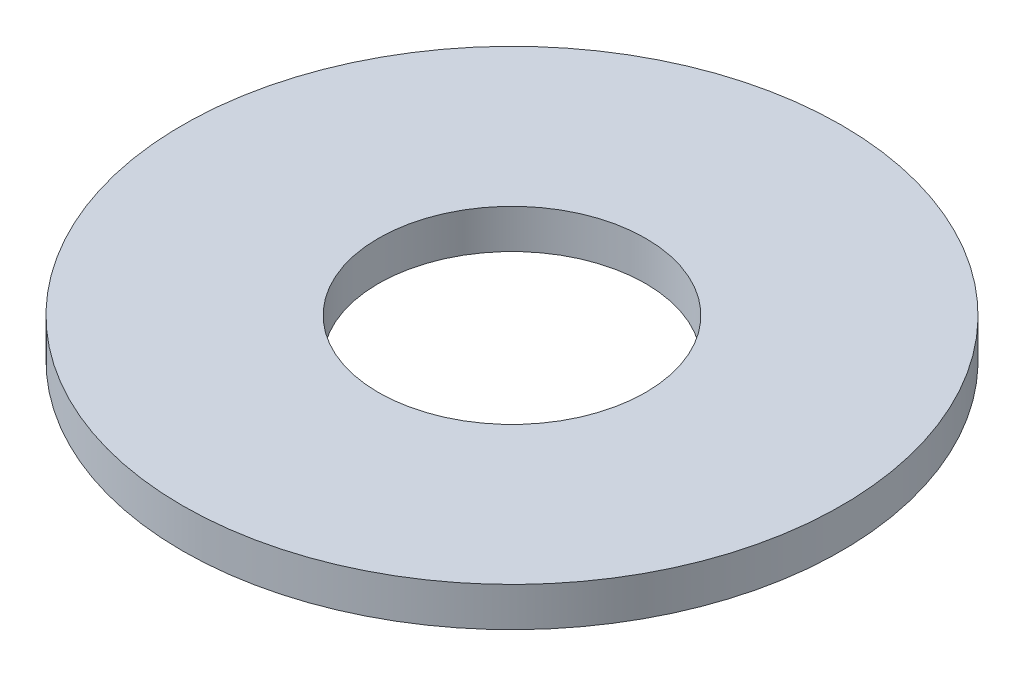
ISO-10303-21;
HEADER;
FILE_DESCRIPTION(('STEP AP214'),'2;1');
FILE_NAME('part.step','',(''),(''),'','','');
FILE_SCHEMA(('AUTOMOTIVE_DESIGN { 1 0 10303 214 1 1 1 1 }'));
ENDSEC;
DATA;
#1=APPLICATION_CONTEXT('core data for automotive mechanical design processes');
#2=APPLICATION_PROTOCOL_DEFINITION('international standard','automotive_design',2000,#1);
#3=PRODUCT_CONTEXT('',#1,'mechanical');
#4=PRODUCT('Part','Part','',(#3));
#5=PRODUCT_RELATED_PRODUCT_CATEGORY('part','',(#4));
#6=PRODUCT_DEFINITION_FORMATION('','',#4);
#7=PRODUCT_DEFINITION_CONTEXT('part definition',#1,'design');
#8=PRODUCT_DEFINITION('design','',#6,#7);
#9=PRODUCT_DEFINITION_SHAPE('','',#8);
#10=(LENGTH_UNIT() NAMED_UNIT(*) SI_UNIT(.MILLI.,.METRE.));
#11=(NAMED_UNIT(*) PLANE_ANGLE_UNIT() SI_UNIT($,.RADIAN.));
#12=(NAMED_UNIT(*) SI_UNIT($,.STERADIAN.) SOLID_ANGLE_UNIT());
#13=UNCERTAINTY_MEASURE_WITH_UNIT(LENGTH_MEASURE(1.E-05),#10,'distance_accuracy_value','');
#14=(GEOMETRIC_REPRESENTATION_CONTEXT(3) GLOBAL_UNCERTAINTY_ASSIGNED_CONTEXT((#13)) GLOBAL_UNIT_ASSIGNED_CONTEXT((#10,
#11,#12)) REPRESENTATION_CONTEXT('',''));
#15=CARTESIAN_POINT('',(0.,0.,0.));
#16=DIRECTION('',(0.,0.,1.));
#17=DIRECTION('',(1.,0.,0.));
#18=AXIS2_PLACEMENT_3D('',#15,#16,#17);
#19=CARTESIAN_POINT('',(0.,11.,0.));
#20=DIRECTION('',(0.,-1.,0.));
#21=DIRECTION('',(0.,0.,-1.));
#22=AXIS2_PLACEMENT_3D('',#19,#20,#21);
#23=CYLINDRICAL_SURFACE('',#22,92.5);
#24=CARTESIAN_POINT('',(0.,11.,0.));
#25=DIRECTION('',(0.,1.,0.));
#26=DIRECTION('',(0.,0.,1.));
#27=AXIS2_PLACEMENT_3D('',#24,#25,#26);
#28=CIRCLE('',#27,92.5);
#29=CARTESIAN_POINT('',(0.,11.,92.5));
#30=VERTEX_POINT('',#29);
#31=EDGE_CURVE('E10',#30,#30,#28,.T.);
#32=ORIENTED_EDGE('',*,*,#31,.F.);
#33=EDGE_LOOP('',(#32));
#34=FACE_BOUND('',#33,.T.);
#35=CARTESIAN_POINT('',(0.,0.,0.));
#36=DIRECTION('',(0.,1.,0.));
#37=DIRECTION('',(0.,0.,1.));
#38=AXIS2_PLACEMENT_3D('',#35,#36,#37);
#39=CIRCLE('',#38,92.5);
#40=CARTESIAN_POINT('',(0.,0.,92.5));
#41=VERTEX_POINT('',#40);
#42=EDGE_CURVE('E37',#41,#41,#39,.T.);
#43=ORIENTED_EDGE('',*,*,#42,.T.);
#44=EDGE_LOOP('',(#43));
#45=FACE_BOUND('',#44,.T.);
#46=ADVANCED_FACE('F40',(#34,#45),#23,.T.);
#47=CARTESIAN_POINT('',(0.,11.,0.));
#48=DIRECTION('',(0.,1.,0.));
#49=DIRECTION('',(0.,0.,1.));
#50=AXIS2_PLACEMENT_3D('',#47,#48,#49);
#51=PLANE('',#50);
#52=CARTESIAN_POINT('',(0.,11.,0.));
#53=DIRECTION('',(0.,1.,0.));
#54=DIRECTION('',(0.,0.,1.));
#55=AXIS2_PLACEMENT_3D('',#52,#53,#54);
#56=CIRCLE('',#55,37.5);
#57=CARTESIAN_POINT('',(0.,11.,37.5));
#58=VERTEX_POINT('',#57);
#59=EDGE_CURVE('E50',#58,#58,#56,.T.);
#60=ORIENTED_EDGE('',*,*,#59,.F.);
#61=EDGE_LOOP('',(#60));
#62=FACE_BOUND('',#61,.T.);
#63=ORIENTED_EDGE('',*,*,#31,.T.);
#64=EDGE_LOOP('',(#63));
#65=FACE_BOUND('',#64,.T.);
#66=ADVANCED_FACE('F59',(#62,#65),#51,.T.);
#67=CARTESIAN_POINT('',(0.,0.,0.));
#68=DIRECTION('',(0.,1.,0.));
#69=DIRECTION('',(0.,0.,1.));
#70=AXIS2_PLACEMENT_3D('',#67,#68,#69);
#71=PLANE('',#70);
#72=CARTESIAN_POINT('',(0.,0.,0.));
#73=DIRECTION('',(0.,1.,0.));
#74=DIRECTION('',(0.,0.,1.));
#75=AXIS2_PLACEMENT_3D('',#72,#73,#74);
#76=CIRCLE('',#75,37.5);
#77=CARTESIAN_POINT('',(0.,0.,37.5));
#78=VERTEX_POINT('',#77);
#79=EDGE_CURVE('E47',#78,#78,#76,.T.);
#80=ORIENTED_EDGE('',*,*,#79,.T.);
#81=EDGE_LOOP('',(#80));
#82=FACE_BOUND('',#81,.T.);
#83=ORIENTED_EDGE('',*,*,#42,.F.);
#84=EDGE_LOOP('',(#83));
#85=FACE_BOUND('',#84,.T.);
#86=ADVANCED_FACE('F58',(#82,#85),#71,.F.);
#87=CARTESIAN_POINT('',(0.,11.,0.));
#88=DIRECTION('',(0.,-1.,0.));
#89=DIRECTION('',(0.,0.,-1.));
#90=AXIS2_PLACEMENT_3D('',#87,#88,#89);
#91=CYLINDRICAL_SURFACE('',#90,37.5);
#92=ORIENTED_EDGE('',*,*,#59,.T.);
#93=EDGE_LOOP('',(#92));
#94=FACE_BOUND('',#93,.T.);
#95=ORIENTED_EDGE('',*,*,#79,.F.);
#96=EDGE_LOOP('',(#95));
#97=FACE_BOUND('',#96,.T.);
#98=ADVANCED_FACE('F54',(#94,#97),#91,.F.);
#99=CLOSED_SHELL('',(#46,#66,#86,#98));
#100=MANIFOLD_SOLID_BREP('B2',#99);
#101=ADVANCED_BREP_SHAPE_REPRESENTATION('',(#18,#100),#14);
#102=SHAPE_DEFINITION_REPRESENTATION(#9,#101);
ENDSEC;
END-ISO-10303-21;
